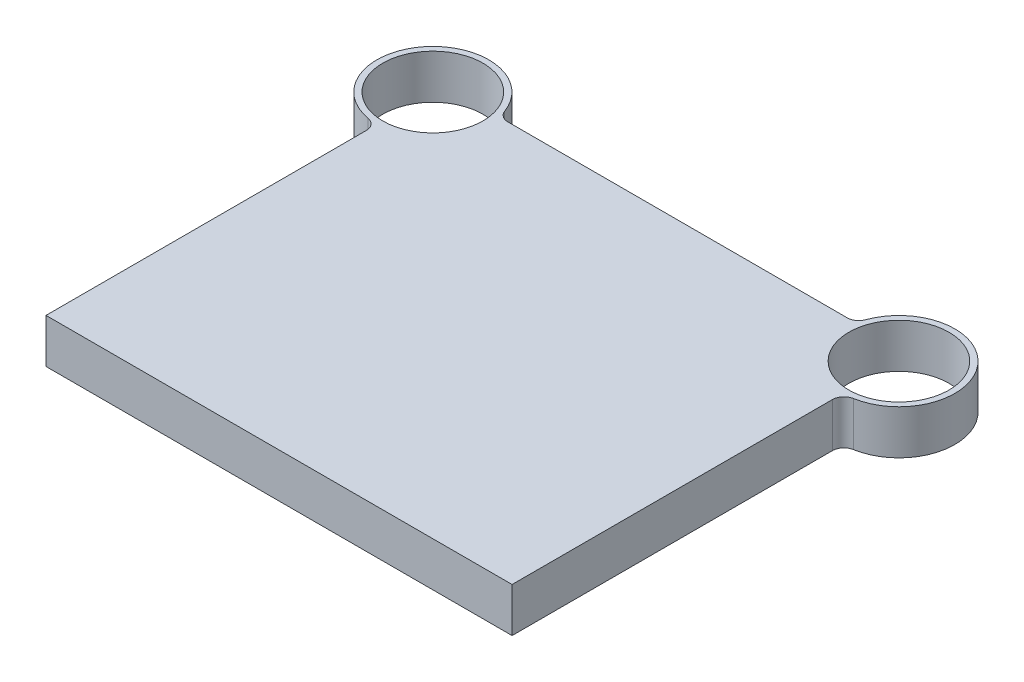
ISO-10303-21;
HEADER;
FILE_DESCRIPTION(('STEP AP214'),'2;1');
FILE_NAME('part.step','',(''),(''),'','','');
FILE_SCHEMA(('AUTOMOTIVE_DESIGN { 1 0 10303 214 1 1 1 1 }'));
ENDSEC;
DATA;
#1=APPLICATION_CONTEXT('core data for automotive mechanical design processes');
#2=APPLICATION_PROTOCOL_DEFINITION('international standard','automotive_design',2000,#1);
#3=PRODUCT_CONTEXT('',#1,'mechanical');
#4=PRODUCT('Part','Part','',(#3));
#5=PRODUCT_RELATED_PRODUCT_CATEGORY('part','',(#4));
#6=PRODUCT_DEFINITION_FORMATION('','',#4);
#7=PRODUCT_DEFINITION_CONTEXT('part definition',#1,'design');
#8=PRODUCT_DEFINITION('design','',#6,#7);
#9=PRODUCT_DEFINITION_SHAPE('','',#8);
#10=(LENGTH_UNIT() NAMED_UNIT(*) SI_UNIT(.MILLI.,.METRE.));
#11=(NAMED_UNIT(*) PLANE_ANGLE_UNIT() SI_UNIT($,.RADIAN.));
#12=(NAMED_UNIT(*) SI_UNIT($,.STERADIAN.) SOLID_ANGLE_UNIT());
#13=UNCERTAINTY_MEASURE_WITH_UNIT(LENGTH_MEASURE(1.E-05),#10,'distance_accuracy_value','');
#14=(GEOMETRIC_REPRESENTATION_CONTEXT(3) GLOBAL_UNCERTAINTY_ASSIGNED_CONTEXT((#13)) GLOBAL_UNIT_ASSIGNED_CONTEXT((#10,
#11,#12)) REPRESENTATION_CONTEXT('',''));
#15=CARTESIAN_POINT('',(0.,0.,0.));
#16=DIRECTION('',(0.,0.,1.));
#17=DIRECTION('',(1.,0.,0.));
#18=AXIS2_PLACEMENT_3D('',#15,#16,#17);
#19=CARTESIAN_POINT('',(-200.,38.,-332.));
#20=DIRECTION('',(0.,1.,0.));
#21=DIRECTION('',(0.,0.,1.));
#22=AXIS2_PLACEMENT_3D('',#19,#20,#21);
#23=PLANE('',#22);
#24=CARTESIAN_POINT('',(-200.,38.,-332.));
#25=DIRECTION('',(0.,1.,0.));
#26=DIRECTION('',(0.,0.,1.));
#27=AXIS2_PLACEMENT_3D('',#24,#25,#26);
#28=CIRCLE('',#27,43.);
#29=CARTESIAN_POINT('',(-200.,38.,-289.));
#30=VERTEX_POINT('',#29);
#31=EDGE_CURVE('E195',#30,#30,#28,.T.);
#32=ORIENTED_EDGE('',*,*,#31,.F.);
#33=EDGE_LOOP('',(#32));
#34=FACE_BOUND('',#33,.T.);
#35=CARTESIAN_POINT('',(-200.,38.,-332.));
#36=DIRECTION('',(0.,1.,0.));
#37=DIRECTION('',(0.,0.,1.));
#38=AXIS2_PLACEMENT_3D('',#35,#36,#37);
#39=CIRCLE('',#38,48.);
#40=CARTESIAN_POINT('',(-154.944030050815,38.,-348.551724137931));
#41=VERTEX_POINT('',#40);
#42=CARTESIAN_POINT('',(-208.275862068966,38.,-284.718818679992));
#43=VERTEX_POINT('',#42);
#44=EDGE_CURVE('E141',#41,#43,#39,.T.);
#45=ORIENTED_EDGE('',*,*,#44,.T.);
#46=CARTESIAN_POINT('',(-210.,38.,-274.868572571657));
#47=DIRECTION('',(0.,1.,0.));
#48=DIRECTION('',(0.,0.,1.));
#49=AXIS2_PLACEMENT_3D('',#46,#47,#48);
#50=CIRCLE('',#49,10.);
#51=CARTESIAN_POINT('',(-200.,38.,-274.868572571657));
#52=VERTEX_POINT('',#51);
#53=EDGE_CURVE('E117',#43,#52,#50,.F.);
#54=ORIENTED_EDGE('',*,*,#53,.T.);
#55=DIRECTION('',(0.,0.,1.));
#56=VECTOR('',#55,1.);
#57=CARTESIAN_POINT('',(-200.,38.,0.));
#58=LINE('',#57,#56);
#59=CARTESIAN_POINT('',(-200.,38.,0.));
#60=VERTEX_POINT('',#59);
#61=EDGE_CURVE('E109',#52,#60,#58,.T.);
#62=ORIENTED_EDGE('',*,*,#61,.T.);
#63=DIRECTION('',(1.,0.,0.));
#64=VECTOR('',#63,1.);
#65=CARTESIAN_POINT('',(200.,38.,0.));
#66=LINE('',#65,#64);
#67=CARTESIAN_POINT('',(200.,38.,0.));
#68=VERTEX_POINT('',#67);
#69=EDGE_CURVE('E114',#60,#68,#66,.T.);
#70=ORIENTED_EDGE('',*,*,#69,.T.);
#71=DIRECTION('',(0.,0.,-1.));
#72=VECTOR('',#71,1.);
#73=CARTESIAN_POINT('',(200.,38.,0.));
#74=LINE('',#73,#72);
#75=CARTESIAN_POINT('',(200.,38.,-274.868572571657));
#76=VERTEX_POINT('',#75);
#77=EDGE_CURVE('E131',#68,#76,#74,.T.);
#78=ORIENTED_EDGE('',*,*,#77,.T.);
#79=CARTESIAN_POINT('',(210.,38.,-274.868572571657));
#80=DIRECTION('',(0.,1.,0.));
#81=DIRECTION('',(0.,0.,1.));
#82=AXIS2_PLACEMENT_3D('',#79,#80,#81);
#83=CIRCLE('',#82,10.);
#84=CARTESIAN_POINT('',(208.275862068966,38.,-284.718818679992));
#85=VERTEX_POINT('',#84);
#86=EDGE_CURVE('E165',#76,#85,#83,.F.);
#87=ORIENTED_EDGE('',*,*,#86,.T.);
#88=CARTESIAN_POINT('',(200.,38.,-332.));
#89=DIRECTION('',(0.,1.,0.));
#90=DIRECTION('',(0.,0.,-1.));
#91=AXIS2_PLACEMENT_3D('',#88,#89,#90);
#92=CIRCLE('',#91,48.);
#93=CARTESIAN_POINT('',(154.944030050815,38.,-348.551724137931));
#94=VERTEX_POINT('',#93);
#95=EDGE_CURVE('E189',#85,#94,#92,.T.);
#96=ORIENTED_EDGE('',*,*,#95,.T.);
#97=CARTESIAN_POINT('',(145.557369644735,38.,-352.));
#98=DIRECTION('',(0.,1.,0.));
#99=DIRECTION('',(0.,0.,1.));
#100=AXIS2_PLACEMENT_3D('',#97,#98,#99);
#101=CIRCLE('',#100,10.);
#102=CARTESIAN_POINT('',(145.557369644735,38.,-342.));
#103=VERTEX_POINT('',#102);
#104=EDGE_CURVE('E55',#94,#103,#101,.F.);
#105=ORIENTED_EDGE('',*,*,#104,.T.);
#106=DIRECTION('',(-1.,0.,0.));
#107=VECTOR('',#106,1.);
#108=CARTESIAN_POINT('',(153.053221622778,38.,-342.));
#109=LINE('',#108,#107);
#110=CARTESIAN_POINT('',(-145.557369644735,38.,-342.));
#111=VERTEX_POINT('',#110);
#112=EDGE_CURVE('E184',#103,#111,#109,.T.);
#113=ORIENTED_EDGE('',*,*,#112,.T.);
#114=CARTESIAN_POINT('',(-145.557369644735,38.,-352.));
#115=DIRECTION('',(0.,1.,0.));
#116=DIRECTION('',(0.,0.,1.));
#117=AXIS2_PLACEMENT_3D('',#114,#115,#116);
#118=CIRCLE('',#117,10.);
#119=EDGE_CURVE('E11',#111,#41,#118,.F.);
#120=ORIENTED_EDGE('',*,*,#119,.T.);
#121=EDGE_LOOP('',(#45,#54,#62,#70,#78,#87,#96,#105,#113,#120));
#122=FACE_BOUND('',#121,.T.);
#123=CARTESIAN_POINT('',(200.,38.,-332.));
#124=DIRECTION('',(0.,1.,0.));
#125=DIRECTION('',(0.,0.,-1.));
#126=AXIS2_PLACEMENT_3D('',#123,#124,#125);
#127=CIRCLE('',#126,43.);
#128=CARTESIAN_POINT('',(200.,38.,-375.));
#129=VERTEX_POINT('',#128);
#130=EDGE_CURVE('E213',#129,#129,#127,.T.);
#131=ORIENTED_EDGE('',*,*,#130,.F.);
#132=EDGE_LOOP('',(#131));
#133=FACE_BOUND('',#132,.T.);
#134=ADVANCED_FACE('F33',(#34,#122,#133),#23,.T.);
#135=CARTESIAN_POINT('',(-200.,0.,-332.));
#136=DIRECTION('',(0.,1.,0.));
#137=DIRECTION('',(0.,0.,1.));
#138=AXIS2_PLACEMENT_3D('',#135,#136,#137);
#139=PLANE('',#138);
#140=DIRECTION('',(0.,0.,1.));
#141=VECTOR('',#140,1.);
#142=CARTESIAN_POINT('',(-200.,0.,0.));
#143=LINE('',#142,#141);
#144=CARTESIAN_POINT('',(-200.,0.,-274.868572571657));
#145=VERTEX_POINT('',#144);
#146=CARTESIAN_POINT('',(-200.,0.,0.));
#147=VERTEX_POINT('',#146);
#148=EDGE_CURVE('E135',#145,#147,#143,.T.);
#149=ORIENTED_EDGE('',*,*,#148,.F.);
#150=CARTESIAN_POINT('',(-210.,0.,-274.868572571657));
#151=DIRECTION('',(0.,1.,0.));
#152=DIRECTION('',(0.,0.,1.));
#153=AXIS2_PLACEMENT_3D('',#150,#151,#152);
#154=CIRCLE('',#153,10.);
#155=CARTESIAN_POINT('',(-208.275862068966,0.,-284.718818679992));
#156=VERTEX_POINT('',#155);
#157=EDGE_CURVE('E160',#145,#156,#154,.T.);
#158=ORIENTED_EDGE('',*,*,#157,.T.);
#159=CARTESIAN_POINT('',(-200.,0.,-332.));
#160=DIRECTION('',(0.,1.,0.));
#161=DIRECTION('',(0.,0.,1.));
#162=AXIS2_PLACEMENT_3D('',#159,#160,#161);
#163=CIRCLE('',#162,48.);
#164=CARTESIAN_POINT('',(-154.944030050815,0.,-348.551724137931));
#165=VERTEX_POINT('',#164);
#166=EDGE_CURVE('E122',#165,#156,#163,.T.);
#167=ORIENTED_EDGE('',*,*,#166,.F.);
#168=CARTESIAN_POINT('',(-145.557369644735,0.,-352.));
#169=DIRECTION('',(0.,1.,0.));
#170=DIRECTION('',(0.,0.,1.));
#171=AXIS2_PLACEMENT_3D('',#168,#169,#170);
#172=CIRCLE('',#171,10.);
#173=CARTESIAN_POINT('',(-145.557369644735,0.,-342.));
#174=VERTEX_POINT('',#173);
#175=EDGE_CURVE('E41',#165,#174,#172,.T.);
#176=ORIENTED_EDGE('',*,*,#175,.T.);
#177=DIRECTION('',(-1.,0.,0.));
#178=VECTOR('',#177,1.);
#179=CARTESIAN_POINT('',(153.053221622778,0.,-342.));
#180=LINE('',#179,#178);
#181=CARTESIAN_POINT('',(145.557369644735,0.,-342.));
#182=VERTEX_POINT('',#181);
#183=EDGE_CURVE('E174',#182,#174,#180,.T.);
#184=ORIENTED_EDGE('',*,*,#183,.F.);
#185=CARTESIAN_POINT('',(145.557369644735,0.,-352.));
#186=DIRECTION('',(0.,1.,0.));
#187=DIRECTION('',(0.,0.,1.));
#188=AXIS2_PLACEMENT_3D('',#185,#186,#187);
#189=CIRCLE('',#188,10.);
#190=CARTESIAN_POINT('',(154.944030050815,0.,-348.551724137931));
#191=VERTEX_POINT('',#190);
#192=EDGE_CURVE('E167',#182,#191,#189,.T.);
#193=ORIENTED_EDGE('',*,*,#192,.T.);
#194=CARTESIAN_POINT('',(200.,0.,-332.));
#195=DIRECTION('',(0.,1.,0.));
#196=DIRECTION('',(0.,0.,-1.));
#197=AXIS2_PLACEMENT_3D('',#194,#195,#196);
#198=CIRCLE('',#197,48.);
#199=CARTESIAN_POINT('',(208.275862068966,0.,-284.718818679992));
#200=VERTEX_POINT('',#199);
#201=EDGE_CURVE('E180',#200,#191,#198,.T.);
#202=ORIENTED_EDGE('',*,*,#201,.F.);
#203=CARTESIAN_POINT('',(210.,0.,-274.868572571657));
#204=DIRECTION('',(0.,1.,0.));
#205=DIRECTION('',(0.,0.,1.));
#206=AXIS2_PLACEMENT_3D('',#203,#204,#205);
#207=CIRCLE('',#206,10.);
#208=CARTESIAN_POINT('',(200.,0.,-274.868572571657));
#209=VERTEX_POINT('',#208);
#210=EDGE_CURVE('E163',#200,#209,#207,.T.);
#211=ORIENTED_EDGE('',*,*,#210,.T.);
#212=DIRECTION('',(0.,0.,-1.));
#213=VECTOR('',#212,1.);
#214=CARTESIAN_POINT('',(200.,0.,0.));
#215=LINE('',#214,#213);
#216=CARTESIAN_POINT('',(200.,0.,0.));
#217=VERTEX_POINT('',#216);
#218=EDGE_CURVE('E197',#217,#209,#215,.T.);
#219=ORIENTED_EDGE('',*,*,#218,.F.);
#220=DIRECTION('',(1.,0.,0.));
#221=VECTOR('',#220,1.);
#222=CARTESIAN_POINT('',(200.,0.,0.));
#223=LINE('',#222,#221);
#224=EDGE_CURVE('E194',#147,#217,#223,.T.);
#225=ORIENTED_EDGE('',*,*,#224,.F.);
#226=EDGE_LOOP('',(#149,#158,#167,#176,#184,#193,#202,#211,#219,#225));
#227=FACE_BOUND('',#226,.T.);
#228=CARTESIAN_POINT('',(-200.,0.,-332.));
#229=DIRECTION('',(0.,1.,0.));
#230=DIRECTION('',(0.,0.,1.));
#231=AXIS2_PLACEMENT_3D('',#228,#229,#230);
#232=CIRCLE('',#231,43.);
#233=CARTESIAN_POINT('',(-200.,0.,-289.));
#234=VERTEX_POINT('',#233);
#235=EDGE_CURVE('E210',#234,#234,#232,.T.);
#236=ORIENTED_EDGE('',*,*,#235,.T.);
#237=EDGE_LOOP('',(#236));
#238=FACE_BOUND('',#237,.T.);
#239=CARTESIAN_POINT('',(200.,0.,-332.));
#240=DIRECTION('',(0.,1.,0.));
#241=DIRECTION('',(0.,0.,-1.));
#242=AXIS2_PLACEMENT_3D('',#239,#240,#241);
#243=CIRCLE('',#242,43.);
#244=CARTESIAN_POINT('',(200.,0.,-375.));
#245=VERTEX_POINT('',#244);
#246=EDGE_CURVE('E216',#245,#245,#243,.T.);
#247=ORIENTED_EDGE('',*,*,#246,.T.);
#248=EDGE_LOOP('',(#247));
#249=FACE_BOUND('',#248,.T.);
#250=ADVANCED_FACE('F172',(#227,#238,#249),#139,.F.);
#251=CARTESIAN_POINT('',(-200.,38.,0.));
#252=DIRECTION('',(1.,0.,0.));
#253=DIRECTION('',(0.,0.,-1.));
#254=AXIS2_PLACEMENT_3D('',#251,#252,#253);
#255=PLANE('',#254);
#256=ORIENTED_EDGE('',*,*,#61,.F.);
#257=DIRECTION('',(0.,1.,0.));
#258=VECTOR('',#257,1.);
#259=CARTESIAN_POINT('',(-200.,0.,-274.868572571657));
#260=LINE('',#259,#258);
#261=EDGE_CURVE('E137',#52,#145,#260,.F.);
#262=ORIENTED_EDGE('',*,*,#261,.T.);
#263=ORIENTED_EDGE('',*,*,#148,.T.);
#264=DIRECTION('',(0.,-1.,0.));
#265=VECTOR('',#264,1.);
#266=CARTESIAN_POINT('',(-200.,38.,0.));
#267=LINE('',#266,#265);
#268=EDGE_CURVE('E127',#60,#147,#267,.T.);
#269=ORIENTED_EDGE('',*,*,#268,.F.);
#270=EDGE_LOOP('',(#256,#262,#263,#269));
#271=FACE_BOUND('',#270,.T.);
#272=ADVANCED_FACE('F133',(#271),#255,.F.);
#273=CARTESIAN_POINT('',(200.,38.,0.));
#274=DIRECTION('',(0.,0.,-1.));
#275=DIRECTION('',(-1.,0.,0.));
#276=AXIS2_PLACEMENT_3D('',#273,#274,#275);
#277=PLANE('',#276);
#278=ORIENTED_EDGE('',*,*,#224,.T.);
#279=DIRECTION('',(0.,-1.,0.));
#280=VECTOR('',#279,1.);
#281=CARTESIAN_POINT('',(200.,38.,0.));
#282=LINE('',#281,#280);
#283=EDGE_CURVE('E129',#68,#217,#282,.T.);
#284=ORIENTED_EDGE('',*,*,#283,.F.);
#285=ORIENTED_EDGE('',*,*,#69,.F.);
#286=ORIENTED_EDGE('',*,*,#268,.T.);
#287=EDGE_LOOP('',(#278,#284,#285,#286));
#288=FACE_BOUND('',#287,.T.);
#289=ADVANCED_FACE('F126',(#288),#277,.F.);
#290=CARTESIAN_POINT('',(200.,38.,0.));
#291=DIRECTION('',(-1.,0.,0.));
#292=DIRECTION('',(0.,0.,1.));
#293=AXIS2_PLACEMENT_3D('',#290,#291,#292);
#294=PLANE('',#293);
#295=ORIENTED_EDGE('',*,*,#218,.T.);
#296=DIRECTION('',(0.,1.,0.));
#297=VECTOR('',#296,1.);
#298=CARTESIAN_POINT('',(200.,38.,-274.868572571657));
#299=LINE('',#298,#297);
#300=EDGE_CURVE('E154',#209,#76,#299,.T.);
#301=ORIENTED_EDGE('',*,*,#300,.T.);
#302=ORIENTED_EDGE('',*,*,#77,.F.);
#303=ORIENTED_EDGE('',*,*,#283,.T.);
#304=EDGE_LOOP('',(#295,#301,#302,#303));
#305=FACE_BOUND('',#304,.T.);
#306=ADVANCED_FACE('F205',(#305),#294,.F.);
#307=CARTESIAN_POINT('',(200.,38.,-332.));
#308=DIRECTION('',(0.,-1.,0.));
#309=DIRECTION('',(0.,0.,-1.));
#310=AXIS2_PLACEMENT_3D('',#307,#308,#309);
#311=CYLINDRICAL_SURFACE('',#310,48.);
#312=ORIENTED_EDGE('',*,*,#95,.F.);
#313=DIRECTION('',(0.,-1.,0.));
#314=VECTOR('',#313,1.);
#315=CARTESIAN_POINT('',(208.275862068966,38.,-284.718818679992));
#316=LINE('',#315,#314);
#317=EDGE_CURVE('E151',#85,#200,#316,.T.);
#318=ORIENTED_EDGE('',*,*,#317,.T.);
#319=ORIENTED_EDGE('',*,*,#201,.T.);
#320=DIRECTION('',(0.,-1.,0.));
#321=VECTOR('',#320,1.);
#322=CARTESIAN_POINT('',(154.944030050815,38.,-348.551724137931));
#323=LINE('',#322,#321);
#324=EDGE_CURVE('E149',#191,#94,#323,.F.);
#325=ORIENTED_EDGE('',*,*,#324,.T.);
#326=EDGE_LOOP('',(#312,#318,#319,#325));
#327=FACE_BOUND('',#326,.T.);
#328=ADVANCED_FACE('F240',(#327),#311,.T.);
#329=CARTESIAN_POINT('',(153.053221622778,38.,-342.));
#330=DIRECTION('',(0.,0.,1.));
#331=DIRECTION('',(1.,0.,0.));
#332=AXIS2_PLACEMENT_3D('',#329,#330,#331);
#333=PLANE('',#332);
#334=ORIENTED_EDGE('',*,*,#112,.F.);
#335=DIRECTION('',(0.,1.,0.));
#336=VECTOR('',#335,1.);
#337=CARTESIAN_POINT('',(145.557369644735,0.,-342.));
#338=LINE('',#337,#336);
#339=EDGE_CURVE('E157',#103,#182,#338,.F.);
#340=ORIENTED_EDGE('',*,*,#339,.T.);
#341=ORIENTED_EDGE('',*,*,#183,.T.);
#342=DIRECTION('',(0.,1.,0.));
#343=VECTOR('',#342,1.);
#344=CARTESIAN_POINT('',(-145.557369644735,38.,-342.));
#345=LINE('',#344,#343);
#346=EDGE_CURVE('E48',#174,#111,#345,.T.);
#347=ORIENTED_EDGE('',*,*,#346,.T.);
#348=EDGE_LOOP('',(#334,#340,#341,#347));
#349=FACE_BOUND('',#348,.T.);
#350=ADVANCED_FACE('F178',(#349),#333,.F.);
#351=CARTESIAN_POINT('',(-200.,38.,-332.));
#352=DIRECTION('',(0.,-1.,0.));
#353=DIRECTION('',(0.,0.,-1.));
#354=AXIS2_PLACEMENT_3D('',#351,#352,#353);
#355=CYLINDRICAL_SURFACE('',#354,48.);
#356=ORIENTED_EDGE('',*,*,#166,.T.);
#357=DIRECTION('',(0.,-1.,0.));
#358=VECTOR('',#357,1.);
#359=CARTESIAN_POINT('',(-208.275862068966,38.,-284.718818679992));
#360=LINE('',#359,#358);
#361=EDGE_CURVE('E147',#156,#43,#360,.F.);
#362=ORIENTED_EDGE('',*,*,#361,.T.);
#363=ORIENTED_EDGE('',*,*,#44,.F.);
#364=DIRECTION('',(0.,-1.,0.));
#365=VECTOR('',#364,1.);
#366=CARTESIAN_POINT('',(-154.944030050815,38.,-348.551724137931));
#367=LINE('',#366,#365);
#368=EDGE_CURVE('E139',#41,#165,#367,.T.);
#369=ORIENTED_EDGE('',*,*,#368,.T.);
#370=EDGE_LOOP('',(#356,#362,#363,#369));
#371=FACE_BOUND('',#370,.T.);
#372=ADVANCED_FACE('F186',(#371),#355,.T.);
#373=CARTESIAN_POINT('',(-200.,38.,-332.));
#374=DIRECTION('',(0.,-1.,0.));
#375=DIRECTION('',(0.,0.,-1.));
#376=AXIS2_PLACEMENT_3D('',#373,#374,#375);
#377=CYLINDRICAL_SURFACE('',#376,43.);
#378=ORIENTED_EDGE('',*,*,#31,.T.);
#379=EDGE_LOOP('',(#378));
#380=FACE_BOUND('',#379,.T.);
#381=ORIENTED_EDGE('',*,*,#235,.F.);
#382=EDGE_LOOP('',(#381));
#383=FACE_BOUND('',#382,.T.);
#384=ADVANCED_FACE('F233',(#380,#383),#377,.F.);
#385=CARTESIAN_POINT('',(200.,38.,-332.));
#386=DIRECTION('',(0.,-1.,0.));
#387=DIRECTION('',(0.,0.,-1.));
#388=AXIS2_PLACEMENT_3D('',#385,#386,#387);
#389=CYLINDRICAL_SURFACE('',#388,43.);
#390=ORIENTED_EDGE('',*,*,#130,.T.);
#391=EDGE_LOOP('',(#390));
#392=FACE_BOUND('',#391,.T.);
#393=ORIENTED_EDGE('',*,*,#246,.F.);
#394=EDGE_LOOP('',(#393));
#395=FACE_BOUND('',#394,.T.);
#396=ADVANCED_FACE('F222',(#392,#395),#389,.F.);
#397=CARTESIAN_POINT('',(-210.,38.,-274.868572571657));
#398=DIRECTION('',(0.,-1.,0.));
#399=DIRECTION('',(0.,0.,-1.));
#400=AXIS2_PLACEMENT_3D('',#397,#398,#399);
#401=CYLINDRICAL_SURFACE('',#400,10.);
#402=ORIENTED_EDGE('',*,*,#53,.F.);
#403=ORIENTED_EDGE('',*,*,#361,.F.);
#404=ORIENTED_EDGE('',*,*,#157,.F.);
#405=ORIENTED_EDGE('',*,*,#261,.F.);
#406=EDGE_LOOP('',(#402,#403,#404,#405));
#407=FACE_BOUND('',#406,.T.);
#408=ADVANCED_FACE('F202',(#407),#401,.F.);
#409=CARTESIAN_POINT('',(210.,38.,-274.868572571657));
#410=DIRECTION('',(0.,-1.,0.));
#411=DIRECTION('',(0.,0.,-1.));
#412=AXIS2_PLACEMENT_3D('',#409,#410,#411);
#413=CYLINDRICAL_SURFACE('',#412,10.);
#414=ORIENTED_EDGE('',*,*,#86,.F.);
#415=ORIENTED_EDGE('',*,*,#300,.F.);
#416=ORIENTED_EDGE('',*,*,#210,.F.);
#417=ORIENTED_EDGE('',*,*,#317,.F.);
#418=EDGE_LOOP('',(#414,#415,#416,#417));
#419=FACE_BOUND('',#418,.T.);
#420=ADVANCED_FACE('F252',(#419),#413,.F.);
#421=CARTESIAN_POINT('',(145.557369644735,38.,-352.));
#422=DIRECTION('',(0.,-1.,0.));
#423=DIRECTION('',(0.,0.,-1.));
#424=AXIS2_PLACEMENT_3D('',#421,#422,#423);
#425=CYLINDRICAL_SURFACE('',#424,10.);
#426=ORIENTED_EDGE('',*,*,#104,.F.);
#427=ORIENTED_EDGE('',*,*,#324,.F.);
#428=ORIENTED_EDGE('',*,*,#192,.F.);
#429=ORIENTED_EDGE('',*,*,#339,.F.);
#430=EDGE_LOOP('',(#426,#427,#428,#429));
#431=FACE_BOUND('',#430,.T.);
#432=ADVANCED_FACE('F254',(#431),#425,.F.);
#433=CARTESIAN_POINT('',(-145.557369644735,38.,-352.));
#434=DIRECTION('',(0.,-1.,0.));
#435=DIRECTION('',(0.,0.,-1.));
#436=AXIS2_PLACEMENT_3D('',#433,#434,#435);
#437=CYLINDRICAL_SURFACE('',#436,10.);
#438=ORIENTED_EDGE('',*,*,#119,.F.);
#439=ORIENTED_EDGE('',*,*,#346,.F.);
#440=ORIENTED_EDGE('',*,*,#175,.F.);
#441=ORIENTED_EDGE('',*,*,#368,.F.);
#442=EDGE_LOOP('',(#438,#439,#440,#441));
#443=FACE_BOUND('',#442,.T.);
#444=ADVANCED_FACE('F35',(#443),#437,.F.);
#445=CLOSED_SHELL('',(#134,#250,#272,#289,#306,#328,#350,#372,#384,#396,#408,#420,#432,#444));
#446=MANIFOLD_SOLID_BREP('B2',#445);
#447=ADVANCED_BREP_SHAPE_REPRESENTATION('',(#18,#446),#14);
#448=SHAPE_DEFINITION_REPRESENTATION(#9,#447);
ENDSEC;
END-ISO-10303-21;
